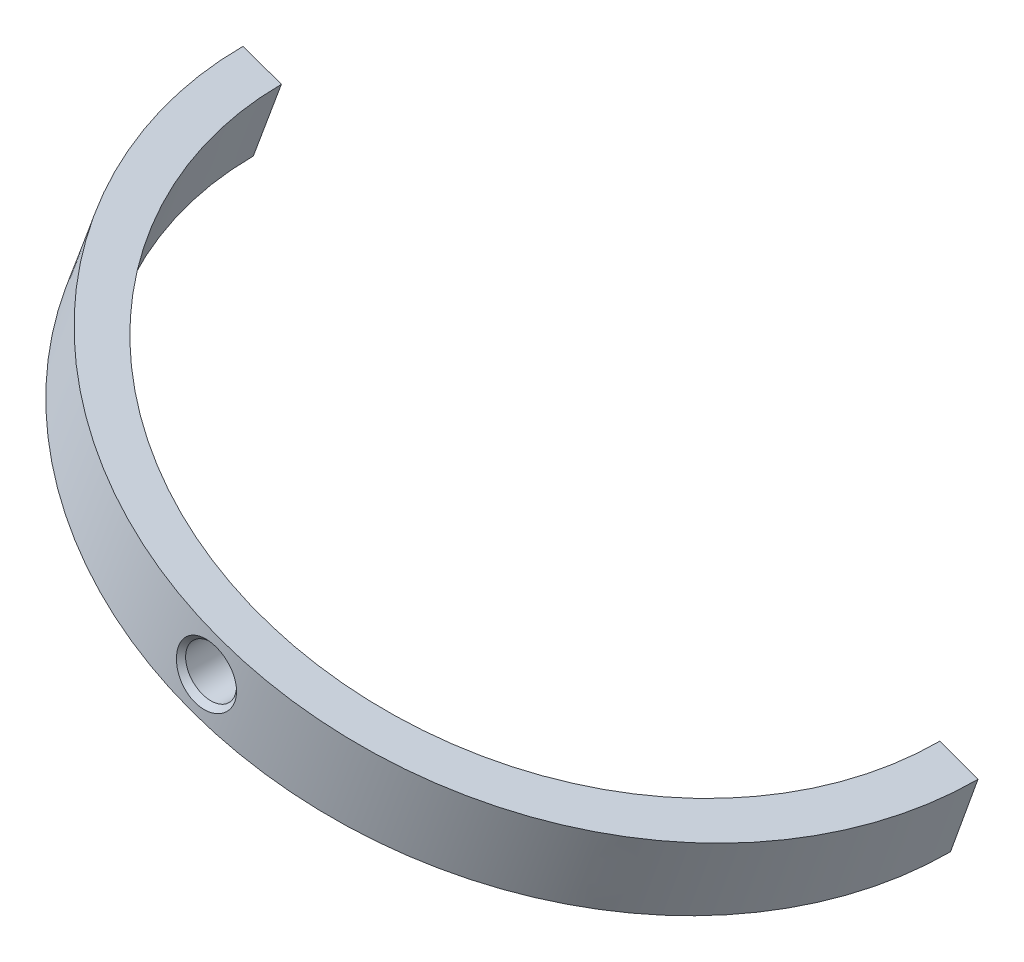
ISO-10303-21;
HEADER;
FILE_DESCRIPTION(('STEP AP214'),'2;1');
FILE_NAME('part.step','',(''),(''),'','','');
FILE_SCHEMA(('AUTOMOTIVE_DESIGN { 1 0 10303 214 1 1 1 1 }'));
ENDSEC;
DATA;
#1=APPLICATION_CONTEXT('core data for automotive mechanical design processes');
#2=APPLICATION_PROTOCOL_DEFINITION('international standard','automotive_design',2000,#1);
#3=PRODUCT_CONTEXT('',#1,'mechanical');
#4=PRODUCT('Part','Part','',(#3));
#5=PRODUCT_RELATED_PRODUCT_CATEGORY('part','',(#4));
#6=PRODUCT_DEFINITION_FORMATION('','',#4);
#7=PRODUCT_DEFINITION_CONTEXT('part definition',#1,'design');
#8=PRODUCT_DEFINITION('design','',#6,#7);
#9=PRODUCT_DEFINITION_SHAPE('','',#8);
#10=(LENGTH_UNIT() NAMED_UNIT(*) SI_UNIT(.MILLI.,.METRE.));
#11=(NAMED_UNIT(*) PLANE_ANGLE_UNIT() SI_UNIT($,.RADIAN.));
#12=(NAMED_UNIT(*) SI_UNIT($,.STERADIAN.) SOLID_ANGLE_UNIT());
#13=UNCERTAINTY_MEASURE_WITH_UNIT(LENGTH_MEASURE(1.E-05),#10,'distance_accuracy_value','');
#14=(GEOMETRIC_REPRESENTATION_CONTEXT(3) GLOBAL_UNCERTAINTY_ASSIGNED_CONTEXT((#13)) GLOBAL_UNIT_ASSIGNED_CONTEXT((#10,
#11,#12)) REPRESENTATION_CONTEXT('',''));
#15=CARTESIAN_POINT('',(0.,0.,0.));
#16=DIRECTION('',(0.,0.,1.));
#17=DIRECTION('',(1.,0.,0.));
#18=AXIS2_PLACEMENT_3D('',#15,#16,#17);
#19=CARTESIAN_POINT('',(-391.399782754615,-16.5265002492836,-1.20308871730642E-13));
#20=DIRECTION('',(-0.342020143325669,-0.939692620785908,0.));
#21=DIRECTION('',(0.939692620785908,-0.342020143325669,0.));
#22=AXIS2_PLACEMENT_3D('',#19,#20,#21);
#23=PLANE('',#22);
#24=CARTESIAN_POINT('',(-375.209898288868,-22.4191362910243,0.));
#25=DIRECTION('',(0.342020143325669,0.939692620785908,0.));
#26=DIRECTION('',(-0.939692620785908,0.342020143325669,0.));
#27=AXIS2_PLACEMENT_3D('',#24,#25,#26);
#28=CIRCLE('',#27,17.2289151874008);
#29=CARTESIAN_POINT('',(-391.399782754615,-16.5265002492837,-1.20308871730642E-13));
#30=VERTEX_POINT('',#29);
#31=CARTESIAN_POINT('',(-359.020013823121,-28.3117723327649,0.));
#32=VERTEX_POINT('',#31);
#33=EDGE_CURVE('E57',#30,#32,#28,.T.);
#34=ORIENTED_EDGE('',*,*,#33,.F.);
#35=DIRECTION('',(0.93969262078591,-0.342020143325664,0.));
#36=VECTOR('',#35,1.);
#37=CARTESIAN_POINT('',(-391.399782754615,-16.5265002492837,-1.20308871730642E-13));
#38=LINE('',#37,#36);
#39=CARTESIAN_POINT('',(-393.279182598478,-15.8424546478328,-1.34274905597303E-13));
#40=VERTEX_POINT('',#39);
#41=EDGE_CURVE('E120',#40,#30,#38,.T.);
#42=ORIENTED_EDGE('',*,*,#41,.F.);
#43=CARTESIAN_POINT('',(-375.209898288868,-22.4191362910243,0.));
#44=DIRECTION('',(0.342020143325669,0.939692620785908,0.));
#45=DIRECTION('',(-0.939692620785908,0.342020143325669,0.));
#46=AXIS2_PLACEMENT_3D('',#43,#44,#45);
#47=CIRCLE('',#46,19.2289307268349);
#48=CARTESIAN_POINT('',(-357.140613979258,-28.9958179342157,0.));
#49=VERTEX_POINT('',#48);
#50=EDGE_CURVE('E64',#40,#49,#47,.T.);
#51=ORIENTED_EDGE('',*,*,#50,.T.);
#52=DIRECTION('',(-0.939692620785906,0.342020143325674,0.));
#53=VECTOR('',#52,1.);
#54=CARTESIAN_POINT('',(-359.020013823121,-28.3117723327649,0.));
#55=LINE('',#54,#53);
#56=EDGE_CURVE('E103',#49,#32,#55,.T.);
#57=ORIENTED_EDGE('',*,*,#56,.T.);
#58=EDGE_LOOP('',(#34,#42,#51,#57));
#59=FACE_BOUND('',#58,.T.);
#60=ADVANCED_FACE('F43',(#59),#23,.F.);
#61=CARTESIAN_POINT('',(-375.209898288868,-22.4191362910243,0.));
#62=DIRECTION('',(-0.342020143325669,-0.939692620785908,0.));
#63=DIRECTION('',(0.939692620785908,-0.342020143325669,0.));
#64=AXIS2_PLACEMENT_3D('',#61,#62,#63);
#65=CONICAL_SURFACE('',#64,17.2289151874008,0.00394199613323478);
#66=CARTESIAN_POINT('',(-376.777054815375,-25.1934478866609,17.2333472051595));
#67=CARTESIAN_POINT('',(-376.727301891821,-25.2427655661789,17.2353959679344));
#68=CARTESIAN_POINT('',(-376.673353635856,-25.2879316872156,17.237145284943));
#69=CARTESIAN_POINT('',(-376.558597345543,-25.368630479528,17.2398535518702));
#70=CARTESIAN_POINT('',(-376.497781715193,-25.4041523325321,17.2408116166555));
#71=CARTESIAN_POINT('',(-376.371070641849,-25.4644947018871,17.2418317053707));
#72=CARTESIAN_POINT('',(-376.305177219893,-25.4893194501819,17.2418940839645));
#73=CARTESIAN_POINT('',(-376.170184478453,-25.5275706304137,17.2411168107815));
#74=CARTESIAN_POINT('',(-376.101085902328,-25.5409996915122,17.2402773671705));
#75=CARTESIAN_POINT('',(-375.961665950552,-25.5560902558946,17.2377883144273));
#76=CARTESIAN_POINT('',(-375.891345215507,-25.557757748118,17.2361391180754));
#77=CARTESIAN_POINT('',(-375.751431951866,-25.5493006994426,17.2322081708977));
#78=CARTESIAN_POINT('',(-375.681839458922,-25.5391755838972,17.2299263892505));
#79=CARTESIAN_POINT('',(-375.545218350802,-25.5073948776026,17.2249701543874));
#80=CARTESIAN_POINT('',(-375.478194694925,-25.4857180799845,17.2222949855427));
#81=CARTESIAN_POINT('',(-375.348734403926,-25.4314345070067,17.2168410493663));
#82=CARTESIAN_POINT('',(-375.286297817101,-25.3988276165849,17.2140622809443));
#83=CARTESIAN_POINT('',(-375.167663735047,-25.3235318885195,17.2086912708661));
#84=CARTESIAN_POINT('',(-375.111477697929,-25.2808249697841,17.2060993747351));
#85=CARTESIAN_POINT('',(-375.007070466899,-25.1865653006265,17.2013809102047));
#86=CARTESIAN_POINT('',(-374.958849199215,-25.1350126321452,17.1992543374954));
#87=CARTESIAN_POINT('',(-374.871794041156,-25.024579772288,17.195687941454));
#88=CARTESIAN_POINT('',(-374.832950199652,-24.9657074498176,17.1942473885385));
#89=CARTESIAN_POINT('',(-374.765695493403,-24.8422652031533,17.1921903745392));
#90=CARTESIAN_POINT('',(-374.737284475829,-24.777695362439,17.1915739013832));
#91=CARTESIAN_POINT('',(-374.691759696467,-24.6448520685444,17.1912119719857));
#92=CARTESIAN_POINT('',(-374.674620314669,-24.5765873988253,17.1914645322562));
#93=CARTESIAN_POINT('',(-374.652018857134,-24.438159690303,17.1927842681964));
#94=CARTESIAN_POINT('',(-374.646556786007,-24.3679966507501,17.1938514441878));
#95=CARTESIAN_POINT('',(-374.64745776873,-24.2277559788921,17.1966572805371));
#96=CARTESIAN_POINT('',(-374.65382164728,-24.1576783528844,17.1983959877185));
#97=CARTESIAN_POINT('',(-374.678188811249,-24.0195897846674,17.2023278285856));
#98=CARTESIAN_POINT('',(-374.696192280489,-23.9515788751151,17.2045209694477));
#99=CARTESIAN_POINT('',(-374.743382590319,-23.8193833931765,17.2091015614284));
#100=CARTESIAN_POINT('',(-374.772595179182,-23.7552080265532,17.2114894498793));
#101=CARTESIAN_POINT('',(-374.841376803317,-23.6326660545597,17.2161696291969));
#102=CARTESIAN_POINT('',(-374.880945904193,-23.5742994859887,17.218461919458));
#103=CARTESIAN_POINT('',(-374.969369498498,-23.4649752281828,17.2226812787875));
#104=CARTESIAN_POINT('',(-375.018232771693,-23.4140246254499,17.2246079990536));
#105=CARTESIAN_POINT('',(-375.123838327061,-23.3210520340123,17.2278656686367));
#106=CARTESIAN_POINT('',(-375.180580506113,-23.2790299284657,17.2291966257504));
#107=CARTESIAN_POINT('',(-375.300217990824,-23.2051877259511,17.2311038301087));
#108=CARTESIAN_POINT('',(-375.3631014965,-23.1733485479494,17.2316814952194));
#109=CARTESIAN_POINT('',(-375.493321443871,-23.120674693654,17.2320187397184));
#110=CARTESIAN_POINT('',(-375.560657831824,-23.0998398845766,17.231778328978));
#111=CARTESIAN_POINT('',(-375.697742281501,-23.069793150159,17.2305087363007));
#112=CARTESIAN_POINT('',(-375.767485853194,-23.0605606722182,17.2294809543439));
#113=CARTESIAN_POINT('',(-375.907521044297,-23.0539055554426,17.22675859749));
#114=CARTESIAN_POINT('',(-375.977812668057,-23.0564830104419,17.225064017295));
#115=CARTESIAN_POINT('',(-376.117035512099,-23.0733759535497,17.2212044708152));
#116=CARTESIAN_POINT('',(-376.185965156455,-23.0877043072206,17.2190389908727));
#117=CARTESIAN_POINT('',(-376.320443315518,-23.1277046789341,17.214493707504));
#118=CARTESIAN_POINT('',(-376.385991781502,-23.1533768603916,17.2121139009908));
#119=CARTESIAN_POINT('',(-376.512006858036,-23.215410880374,17.2074167949417));
#120=CARTESIAN_POINT('',(-376.572461625977,-23.2517967912622,17.2050996491376));
#121=CARTESIAN_POINT('',(-376.686411928761,-23.3342099684149,17.2008130707879));
#122=CARTESIAN_POINT('',(-376.739907456863,-23.3802372440171,17.198843638579));
#123=CARTESIAN_POINT('',(-376.838413788888,-23.4806289747274,17.1954959581076));
#124=CARTESIAN_POINT('',(-376.883425381414,-23.5349926540919,17.1941176548828));
#125=CARTESIAN_POINT('',(-376.963682501415,-23.6505178500536,17.1921306932718));
#126=CARTESIAN_POINT('',(-376.998928168272,-23.7116792696148,17.1915220239008));
#127=CARTESIAN_POINT('',(-377.058574650652,-23.8389097586052,17.1911672850746));
#128=CARTESIAN_POINT('',(-377.08300019552,-23.9049672301873,17.191419237062));
#129=CARTESIAN_POINT('',(-377.1204288444,-24.0402311899615,17.192776274351));
#130=CARTESIAN_POINT('',(-377.133432439066,-24.1094375427523,17.1938813230023));
#131=CARTESIAN_POINT('',(-377.147647481162,-24.2489622847632,17.1968409511719));
#132=CARTESIAN_POINT('',(-377.148870951296,-24.319279466826,17.1986947644926));
#133=CARTESIAN_POINT('',(-377.139528223779,-24.4591270632051,17.2029655769322));
#134=CARTESIAN_POINT('',(-377.128959099414,-24.5286572778829,17.205382715741));
#135=CARTESIAN_POINT('',(-377.096298174391,-24.6651118989558,17.2105346403968));
#136=CARTESIAN_POINT('',(-377.074179176366,-24.7320297523469,17.2132701641024));
#137=CARTESIAN_POINT('',(-377.019041525101,-24.8611504270804,17.2187625641435));
#138=CARTESIAN_POINT('',(-376.986035216947,-24.923358491058,17.221519412857));
#139=CARTESIAN_POINT('',(-376.923515999798,-25.0204874661766,17.2258357702635));
#140=CARTESIAN_POINT('',(-376.896881167572,-25.0572904312994,17.2274744736849));
#141=CARTESIAN_POINT('',(-376.839769649596,-25.1277925866645,17.2305664283368));
#142=CARTESIAN_POINT('',(-376.809292955033,-25.1614917697869,17.232019679142));
#143=CARTESIAN_POINT('',(-376.777054815375,-25.1934478866609,17.2333472051595));
#144=B_SPLINE_CURVE_WITH_KNOTS('',3,(#66,#67,#68,#69,#70,#71,#72,#73,#74,#75,#76,#77,#78,#79,
#80,#81,#82,#83,#84,#85,#86,#87,#88,#89,#90,#91,#92,#93,#94,#95,#96,#97,#98,#99,#100,#101,#102,
#103,#104,#105,#106,#107,#108,#109,#110,#111,#112,#113,#114,#115,#116,#117,#118,#119,#120,#121,
#122,#123,#124,#125,#126,#127,#128,#129,#130,#131,#132,#133,#134,#135,#136,#137,#138,#139,#140,
#141,#142,#143),.UNSPECIFIED.,.T.,.F.,(4,2,2,2,2,2,2,2,2,2,2,2,2,2,2,2,2,2,2,2,2,2,2,2,2,2,2,2,
2,2,2,2,2,2,2,2,2,2,4),(0.,0.210087327473739,0.420409351735569,0.630648092710414,
0.840838315155293,1.05092150192527,1.26101492634864,1.47149538102343,1.68197805151657,
1.89284041955007,2.10370083440265,2.31433649519159,2.52496907027568,2.73512121527064,
2.94527344324342,3.1554403270291,3.36561053000518,3.57626642974437,3.78692366391896,
3.99778089334602,4.20863536324197,4.41909238166745,4.6295468605668,4.83962800828142,
5.04971082516729,5.2600239604015,5.470340125426,5.68113249731802,5.89192507336469,
6.102698046013,6.31346801031567,6.5237537435985,6.73403044316526,6.94409251319806,
7.15420672855809,7.36481796207342,7.5751912004472,7.7113200665217,7.84744924486361),.UNSPECIFIED.);
#145=CARTESIAN_POINT('',(-376.777054815375,-25.1934478866609,17.2333472051595));
#146=VERTEX_POINT('',#145);
#147=EDGE_CURVE('E107',#146,#146,#144,.T.);
#148=ORIENTED_EDGE('',*,*,#147,.T.);
#149=EDGE_LOOP('',(#148));
#150=FACE_BOUND('',#149,.T.);
#151=CARTESIAN_POINT('',(-376.575012374803,-26.1697564171104,0.));
#152=DIRECTION('',(0.342020143325669,0.939692620785908,0.));
#153=DIRECTION('',(-0.939692620785908,0.342020143325669,0.));
#154=AXIS2_PLACEMENT_3D('',#151,#152,#153);
#155=CIRCLE('',#154,17.2446490628089);
#156=CARTESIAN_POINT('',(-392.779681847167,-20.2717390730476,-1.20418740795392E-13));
#157=VERTEX_POINT('',#156);
#158=CARTESIAN_POINT('',(-360.370342902439,-32.0677737611731,0.));
#159=VERTEX_POINT('',#158);
#160=EDGE_CURVE('E101',#157,#159,#155,.T.);
#161=ORIENTED_EDGE('',*,*,#160,.F.);
#162=DIRECTION('',(-0.345721741030511,-0.938337081106162,0.));
#163=VECTOR('',#162,1.);
#164=CARTESIAN_POINT('',(-392.779681847167,-20.2717390730476,-1.20418740795392E-13));
#165=LINE('',#164,#163);
#166=EDGE_CURVE('E97',#30,#157,#165,.T.);
#167=ORIENTED_EDGE('',*,*,#166,.F.);
#168=ORIENTED_EDGE('',*,*,#33,.T.);
#169=DIRECTION('',(-0.338313230862633,-0.941033558287528,0.));
#170=VECTOR('',#169,1.);
#171=CARTESIAN_POINT('',(-360.370342902439,-32.0677737611731,0.));
#172=LINE('',#171,#170);
#173=EDGE_CURVE('E94',#32,#159,#172,.T.);
#174=ORIENTED_EDGE('',*,*,#173,.T.);
#175=EDGE_LOOP('',(#161,#167,#168,#174));
#176=FACE_BOUND('',#175,.T.);
#177=ADVANCED_FACE('F45',(#150,#176),#65,.F.);
#178=CARTESIAN_POINT('',(-376.575012374803,-26.1697564171104,0.));
#179=DIRECTION('',(-0.342020143325669,-0.939692620785908,0.));
#180=DIRECTION('',(0.939692620785908,-0.342020143325669,0.));
#181=AXIS2_PLACEMENT_3D('',#178,#179,#180);
#182=CONICAL_SURFACE('',#181,17.244649062809,1.56648596862145);
#183=CARTESIAN_POINT('',(-376.577960924713,-26.1778574914085,0.));
#184=DIRECTION('',(0.342020143325669,0.939692620785908,0.));
#185=DIRECTION('',(-0.939692620785908,0.342020143325669,0.));
#186=AXIS2_PLACEMENT_3D('',#183,#184,#185);
#187=CIRCLE('',#186,19.2446985863015);
#188=CARTESIAN_POINT('',(-394.662062175509,-19.5957829226623,-1.34385011971465E-13));
#189=VERTEX_POINT('',#188);
#190=CARTESIAN_POINT('',(-358.493859673916,-32.7599320601546,0.));
#191=VERTEX_POINT('',#190);
#192=EDGE_CURVE('E72',#189,#191,#187,.T.);
#193=ORIENTED_EDGE('',*,*,#192,.F.);
#194=DIRECTION('',(-0.941158116191958,0.337966566876081,0.));
#195=VECTOR('',#194,1.);
#196=CARTESIAN_POINT('',(-394.662062175509,-19.5957829226623,-1.34385011971465E-13));
#197=LINE('',#196,#195);
#198=EDGE_CURVE('E125',#157,#189,#197,.T.);
#199=ORIENTED_EDGE('',*,*,#198,.F.);
#200=ORIENTED_EDGE('',*,*,#160,.T.);
#201=DIRECTION('',(0.938209666681417,-0.346067365328695,0.));
#202=VECTOR('',#201,1.);
#203=CARTESIAN_POINT('',(-358.493859673916,-32.7599320601546,0.));
#204=LINE('',#203,#202);
#205=EDGE_CURVE('E110',#159,#191,#204,.T.);
#206=ORIENTED_EDGE('',*,*,#205,.T.);
#207=EDGE_LOOP('',(#193,#199,#200,#206));
#208=FACE_BOUND('',#207,.T.);
#209=ADVANCED_FACE('F137',(#208),#182,.F.);
#210=CARTESIAN_POINT('',(-376.577960924713,-26.1778574914085,0.));
#211=DIRECTION('',(-0.342020143325669,-0.939692620785908,0.));
#212=DIRECTION('',(0.939692620785908,-0.342020143325669,0.));
#213=AXIS2_PLACEMENT_3D('',#210,#211,#212);
#214=CONICAL_SURFACE('',#213,19.2446985863015,0.00394199613322513);
#215=CARTESIAN_POINT('',(-377.0386139415,-25.2849040216058,19.2278434685651));
#216=CARTESIAN_POINT('',(-377.085573959498,-25.2266758483992,19.2252318487154));
#217=CARTESIAN_POINT('',(-377.128053739307,-25.1648101679622,19.2223926381086));
#218=CARTESIAN_POINT('',(-377.203209519125,-25.0353480577632,19.2165093863275));
#219=CARTESIAN_POINT('',(-377.235875651471,-24.967745946982,19.2134651427307));
#220=CARTESIAN_POINT('',(-377.293867036573,-24.8206620178378,19.2070965844672));
#221=CARTESIAN_POINT('',(-377.3179703449,-24.7406954755044,19.2037788157467));
#222=CARTESIAN_POINT('',(-377.352894419755,-24.5779037822659,19.197547684145));
#223=CARTESIAN_POINT('',(-377.363712333049,-24.4950780212269,19.1946344082537));
#224=CARTESIAN_POINT('',(-377.372107204824,-24.3259116055307,19.1894060541207));
#225=CARTESIAN_POINT('',(-377.369222040332,-24.2395471041036,19.1871146495901));
#226=CARTESIAN_POINT('',(-377.349361055132,-24.068434291818,19.1834887060872));
#227=CARTESIAN_POINT('',(-377.332383600726,-23.9836861695093,19.1821542780892));
#228=CARTESIAN_POINT('',(-377.284311925735,-23.8161684702066,19.1805410441287));
#229=CARTESIAN_POINT('',(-377.252903000278,-23.7334887914814,19.1802871396679));
#230=CARTESIAN_POINT('',(-377.176755907223,-23.5745115143027,19.1809027851612));
#231=CARTESIAN_POINT('',(-377.132016785252,-23.4982143733065,19.1817724155695));
#232=CARTESIAN_POINT('',(-377.030155711855,-23.3538615308859,19.1845146208117));
#233=CARTESIAN_POINT('',(-376.97297677955,-23.2858460773252,19.186391871138));
#234=CARTESIAN_POINT('',(-376.847880983793,-23.1605507961173,19.1909073077356));
#235=CARTESIAN_POINT('',(-376.779964542134,-23.1032705469611,19.1935454641203));
#236=CARTESIAN_POINT('',(-376.63631994725,-23.0020786717215,19.1992019166716));
#237=CARTESIAN_POINT('',(-376.560722083067,-22.9579819752735,19.2022140182714));
#238=CARTESIAN_POINT('',(-376.403007992315,-22.8835933551831,19.2082678915348));
#239=CARTESIAN_POINT('',(-376.320892916292,-22.8532990012196,19.2113096578785));
#240=CARTESIAN_POINT('',(-376.155277064616,-22.8084664779757,19.2169376079921));
#241=CARTESIAN_POINT('',(-376.071905155219,-22.7934542217141,19.2195352728174));
#242=CARTESIAN_POINT('',(-375.903802066414,-22.7782229940303,19.2240642222713));
#243=CARTESIAN_POINT('',(-375.819071231529,-22.778000330547,19.2259956730932));
#244=CARTESIAN_POINT('',(-375.654043045441,-22.7922832588897,19.2288891574652));
#245=CARTESIAN_POINT('',(-375.573698421903,-22.8062381566805,19.2298847550468));
#246=CARTESIAN_POINT('',(-375.41659544608,-22.8477333141135,19.2309080945238));
#247=CARTESIAN_POINT('',(-375.339836522595,-22.8752714018334,19.2309359911016));
#248=CARTESIAN_POINT('',(-375.193857143625,-22.9423445811896,19.2300314670245));
#249=CARTESIAN_POINT('',(-375.124506119129,-22.9815964055416,19.2291205954379));
#250=CARTESIAN_POINT('',(-374.993333570938,-23.0710995444465,19.2264781559655));
#251=CARTESIAN_POINT('',(-374.931512057724,-23.1213508743101,19.2247465869374));
#252=CARTESIAN_POINT('',(-374.816678039974,-23.2316447170101,19.2206492922761));
#253=CARTESIAN_POINT('',(-374.763718047851,-23.2917416902188,19.2182799893252));
#254=CARTESIAN_POINT('',(-374.66830545316,-23.4197458983174,19.2131788950565));
#255=CARTESIAN_POINT('',(-374.62585417488,-23.4876541159878,19.2104470581194));
#256=CARTESIAN_POINT('',(-374.551285220168,-23.6314741890461,19.2048385273323));
#257=CARTESIAN_POINT('',(-374.519509314948,-23.707563050489,19.2019599375676));
#258=CARTESIAN_POINT('',(-374.46867751195,-23.8638825124139,19.196460726115));
#259=CARTESIAN_POINT('',(-374.449623854875,-23.9441138398076,19.193840149939));
#260=CARTESIAN_POINT('',(-374.424066170784,-24.1095909893831,19.1890623127817));
#261=CARTESIAN_POINT('',(-374.41804923073,-24.194912727017,19.1869256251695));
#262=CARTESIAN_POINT('',(-374.419988058184,-24.3654143146162,19.1834989923323));
#263=CARTESIAN_POINT('',(-374.427945981589,-24.4505941406596,19.1822091777963));
#264=CARTESIAN_POINT('',(-374.457930424908,-24.620903724638,19.1806180181224));
#265=CARTESIAN_POINT('',(-374.480342503714,-24.7059660486447,19.1803451961052));
#266=CARTESIAN_POINT('',(-374.538932519524,-24.8712100549663,19.1809264994099));
#267=CARTESIAN_POINT('',(-374.575111686344,-24.951391300511,19.181780725428));
#268=CARTESIAN_POINT('',(-374.660722358982,-25.1054513642929,19.1845649599791));
#269=CARTESIAN_POINT('',(-374.710291365924,-25.1792536673164,19.1865063683007));
#270=CARTESIAN_POINT('',(-374.821183648302,-25.3174031962109,19.1912799391884));
#271=CARTESIAN_POINT('',(-374.882506939473,-25.3817504094241,19.1941121029469));
#272=CARTESIAN_POINT('',(-375.014690878499,-25.4984748032031,19.2003376493294));
#273=CARTESIAN_POINT('',(-375.085464873714,-25.5509502652768,19.2037259904818));
#274=CARTESIAN_POINT('',(-375.235018963067,-25.6428774340231,19.2107067784143));
#275=CARTESIAN_POINT('',(-375.313798002334,-25.6823308537829,19.2142991982741));
#276=CARTESIAN_POINT('',(-375.474863340826,-25.7458653985545,19.2211779201299));
#277=CARTESIAN_POINT('',(-375.556995447345,-25.7703363278882,19.2244698979588));
#278=CARTESIAN_POINT('',(-375.724293615774,-25.8045483660467,19.230476738517));
#279=CARTESIAN_POINT('',(-375.809458857566,-25.8142934260529,19.2331917558857));
#280=CARTESIAN_POINT('',(-375.976962648472,-25.818424179366,19.2376360891634));
#281=CARTESIAN_POINT('',(-376.059286443863,-25.8133761890941,19.2393987669272));
#282=CARTESIAN_POINT('',(-376.221849410309,-25.7891183864637,19.2418898699521));
#283=CARTESIAN_POINT('',(-376.302088649263,-25.769909035971,19.2426183289415));
#284=CARTESIAN_POINT('',(-376.455741648858,-25.7186108871384,19.2429518454322));
#285=CARTESIAN_POINT('',(-376.52928581534,-25.6869114141739,19.2425888431614));
#286=CARTESIAN_POINT('',(-376.669935377929,-25.6116125866841,19.2408481657272));
#287=CARTESIAN_POINT('',(-376.737046359891,-25.5680236844369,19.2394713800064));
#288=CARTESIAN_POINT('',(-376.844178971559,-25.4849391547744,19.2363972988778));
#289=CARTESIAN_POINT('',(-376.886305593461,-25.4481079867637,19.2349184770413));
#290=CARTESIAN_POINT('',(-376.965991319261,-25.3698278028618,19.2316165002391));
#291=CARTESIAN_POINT('',(-377.00355145116,-25.3283798303389,19.2297934230084));
#292=CARTESIAN_POINT('',(-377.0386139415,-25.2849040216058,19.2278434685651));
#293=B_SPLINE_CURVE_WITH_KNOTS('',3,(#215,#216,#217,#218,#219,#220,#221,#222,#223,#224,#225,
#226,#227,#228,#229,#230,#231,#232,#233,#234,#235,#236,#237,#238,#239,#240,#241,#242,#243,#244,
#245,#246,#247,#248,#249,#250,#251,#252,#253,#254,#255,#256,#257,#258,#259,#260,#261,#262,#263,
#264,#265,#266,#267,#268,#269,#270,#271,#272,#273,#274,#275,#276,#277,#278,#279,#280,#281,#282,
#283,#284,#285,#286,#287,#288,#289,#290,#291,#292),.UNSPECIFIED.,.T.,.F.,(4,2,2,2,2,2,2,2,2,2,2,
2,2,2,2,2,2,2,2,2,2,2,2,2,2,2,2,2,2,2,2,2,2,2,2,2,2,2,4),(0.,0.224382229896757,
0.448989327683202,0.698598985953151,0.94826224221488,1.2064037776997,1.46457524332836,
1.72866530147448,1.99277427162599,2.25811947334905,2.52345425432156,2.7848675032598,
3.04623470465745,3.29922093040953,3.55214400066168,3.79560484710154,4.03902677729832,
4.27698286830446,4.51493929053919,4.75425937842795,4.9936096096456,5.24002042529974,
5.48647462856803,5.74198876042379,5.99754231380594,6.26021154864678,6.52290425329478,
6.78840447006581,7.0539050422643,7.31711990578671,7.58030012882239,7.83630459183855,
8.09224035264427,8.33850775392471,8.58476712366991,8.82389084391819,9.06280501865547,
9.2303768146775,9.39791081708358),.UNSPECIFIED.);
#294=CARTESIAN_POINT('',(-377.0386139415,-25.2849040216058,19.2278434685651));
#295=VERTEX_POINT('',#294);
#296=EDGE_CURVE('E11',#295,#295,#293,.T.);
#297=ORIENTED_EDGE('',*,*,#296,.T.);
#298=EDGE_LOOP('',(#297));
#299=FACE_BOUND('',#298,.T.);
#300=DIRECTION('',(0.345721741030521,0.938337081106159,0.));
#301=VECTOR('',#300,1.);
#302=CARTESIAN_POINT('',(-394.662062175509,-19.5957829226623,-1.34385011971465E-13));
#303=LINE('',#302,#301);
#304=EDGE_CURVE('E128',#189,#40,#303,.T.);
#305=ORIENTED_EDGE('',*,*,#304,.F.);
#306=ORIENTED_EDGE('',*,*,#192,.T.);
#307=DIRECTION('',(0.338313230862624,0.941033558287532,0.));
#308=VECTOR('',#307,1.);
#309=CARTESIAN_POINT('',(-358.493859673916,-32.7599320601546,0.));
#310=LINE('',#309,#308);
#311=EDGE_CURVE('E114',#191,#49,#310,.T.);
#312=ORIENTED_EDGE('',*,*,#311,.T.);
#313=ORIENTED_EDGE('',*,*,#50,.F.);
#314=EDGE_LOOP('',(#305,#306,#312,#313));
#315=FACE_BOUND('',#314,.T.);
#316=ADVANCED_FACE('F140',(#299,#315),#214,.T.);
#317=CARTESIAN_POINT('',(-648.226612848547,235.935192136073,-2.40852282122777E-12));
#318=DIRECTION('',(0.,0.,-1.));
#319=DIRECTION('',(-0.766044443118978,0.64278760968654,0.));
#320=AXIS2_PLACEMENT_3D('',#317,#318,#319);
#321=PLANE('',#320);
#322=ORIENTED_EDGE('',*,*,#41,.T.);
#323=ORIENTED_EDGE('',*,*,#166,.T.);
#324=ORIENTED_EDGE('',*,*,#198,.T.);
#325=ORIENTED_EDGE('',*,*,#304,.T.);
#326=EDGE_LOOP('',(#322,#323,#324,#325));
#327=FACE_BOUND('',#326,.T.);
#328=ADVANCED_FACE('F139',(#327),#321,.T.);
#329=CARTESIAN_POINT('',(0.,0.,0.));
#330=DIRECTION('',(0.,0.,1.));
#331=DIRECTION('',(1.,0.,0.));
#332=AXIS2_PLACEMENT_3D('',#329,#330,#331);
#333=PLANE('',#332);
#334=ORIENTED_EDGE('',*,*,#56,.F.);
#335=ORIENTED_EDGE('',*,*,#311,.F.);
#336=ORIENTED_EDGE('',*,*,#205,.F.);
#337=ORIENTED_EDGE('',*,*,#173,.F.);
#338=EDGE_LOOP('',(#334,#335,#336,#337));
#339=FACE_BOUND('',#338,.T.);
#340=ADVANCED_FACE('F109',(#339),#333,.F.);
#341=CARTESIAN_POINT('',(-375.894265461216,-24.2983746502026,19.236814653248));
#342=DIRECTION('',(0.00133077978460823,0.00371060956966773,0.999992230170708));
#343=DIRECTION('',(0.,-0.999993115652422,0.00371061285537018));
#344=AXIS2_PLACEMENT_3D('',#341,#342,#343);
#345=CONICAL_SURFACE('',#344,1.52500000000001,0.785398163397524);
#346=CARTESIAN_POINT('',(-375.894631425657,-24.2993950678343,18.961816789951));
#347=DIRECTION('',(0.00133077978460823,0.00371060956966773,0.999992230170708));
#348=DIRECTION('',(0.,-0.999993115652422,0.00371061285537018));
#349=AXIS2_PLACEMENT_3D('',#346,#347,#348);
#350=CIRCLE('',#349,1.24999999999999);
#351=CARTESIAN_POINT('',(-375.894631425657,-25.5493864623998,18.9664550560203));
#352=VERTEX_POINT('',#351);
#353=EDGE_CURVE('E169',#352,#352,#350,.T.);
#354=ORIENTED_EDGE('',*,*,#353,.F.);
#355=EDGE_LOOP('',(#354));
#356=FACE_BOUND('',#355,.T.);
#357=ORIENTED_EDGE('',*,*,#296,.F.);
#358=EDGE_LOOP('',(#357));
#359=FACE_BOUND('',#358,.T.);
#360=ADVANCED_FACE('F158',(#356,#359),#345,.F.);
#361=CARTESIAN_POINT('',(-375.894265461216,-24.2983746502026,19.236814653248));
#362=DIRECTION('',(0.00133077978460823,0.00371060956966773,0.999992230170708));
#363=DIRECTION('',(0.,-0.999993115652422,0.00371061285537018));
#364=AXIS2_PLACEMENT_3D('',#361,#362,#363);
#365=CYLINDRICAL_SURFACE('',#364,1.24999999999999);
#366=ORIENTED_EDGE('',*,*,#147,.F.);
#367=EDGE_LOOP('',(#366));
#368=FACE_BOUND('',#367,.T.);
#369=ORIENTED_EDGE('',*,*,#353,.T.);
#370=EDGE_LOOP('',(#369));
#371=FACE_BOUND('',#370,.T.);
#372=ADVANCED_FACE('F161',(#368,#371),#365,.F.);
#373=CLOSED_SHELL('',(#60,#177,#209,#316,#328,#340,#360,#372));
#374=MANIFOLD_SOLID_BREP('B2',#373);
#375=ADVANCED_BREP_SHAPE_REPRESENTATION('',(#18,#374),#14);
#376=SHAPE_DEFINITION_REPRESENTATION(#9,#375);
ENDSEC;
END-ISO-10303-21;
